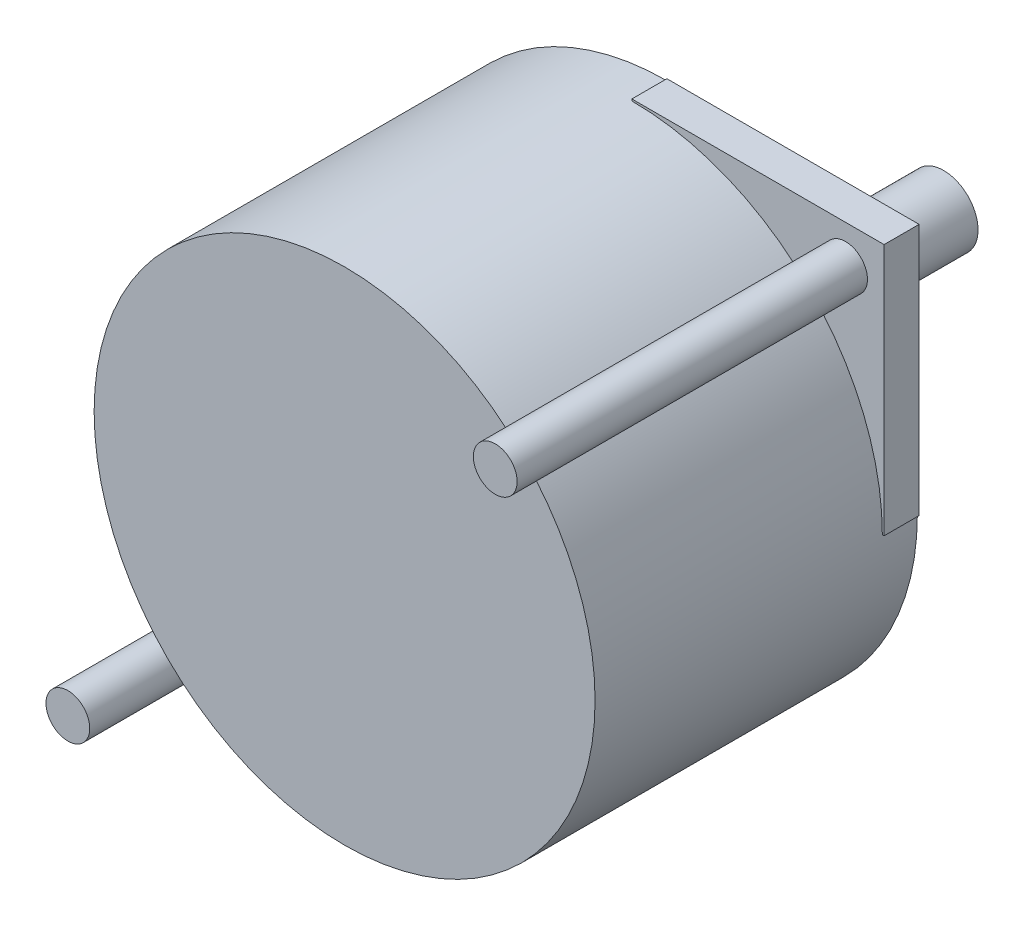
ISO-10303-21;
HEADER;
FILE_DESCRIPTION(('STEP AP214'),'2;1');
FILE_NAME('part.step','',(''),(''),'','','');
FILE_SCHEMA(('AUTOMOTIVE_DESIGN { 1 0 10303 214 1 1 1 1 }'));
ENDSEC;
DATA;
#1=APPLICATION_CONTEXT('core data for automotive mechanical design processes');
#2=APPLICATION_PROTOCOL_DEFINITION('international standard','automotive_design',2000,#1);
#3=PRODUCT_CONTEXT('',#1,'mechanical');
#4=PRODUCT('Part','Part','',(#3));
#5=PRODUCT_RELATED_PRODUCT_CATEGORY('part','',(#4));
#6=PRODUCT_DEFINITION_FORMATION('','',#4);
#7=PRODUCT_DEFINITION_CONTEXT('part definition',#1,'design');
#8=PRODUCT_DEFINITION('design','',#6,#7);
#9=PRODUCT_DEFINITION_SHAPE('','',#8);
#10=(LENGTH_UNIT() NAMED_UNIT(*) SI_UNIT(.MILLI.,.METRE.));
#11=(NAMED_UNIT(*) PLANE_ANGLE_UNIT() SI_UNIT($,.RADIAN.));
#12=(NAMED_UNIT(*) SI_UNIT($,.STERADIAN.) SOLID_ANGLE_UNIT());
#13=UNCERTAINTY_MEASURE_WITH_UNIT(LENGTH_MEASURE(1.E-05),#10,'distance_accuracy_value','');
#14=(GEOMETRIC_REPRESENTATION_CONTEXT(3) GLOBAL_UNCERTAINTY_ASSIGNED_CONTEXT((#13)) GLOBAL_UNIT_ASSIGNED_CONTEXT((#10,
#11,#12)) REPRESENTATION_CONTEXT('',''));
#15=CARTESIAN_POINT('',(0.,0.,0.));
#16=DIRECTION('',(0.,0.,1.));
#17=DIRECTION('',(1.,0.,0.));
#18=AXIS2_PLACEMENT_3D('',#15,#16,#17);
#19=CARTESIAN_POINT('',(0.,0.,2.54));
#20=DIRECTION('',(0.,0.,1.));
#21=DIRECTION('',(1.,0.,0.));
#22=AXIS2_PLACEMENT_3D('',#19,#20,#21);
#23=PLANE('',#22);
#24=CARTESIAN_POINT('',(2.15591616766473,-32.8378083832335,2.54));
#25=DIRECTION('',(0.,0.,1.));
#26=DIRECTION('',(1.,0.,0.));
#27=AXIS2_PLACEMENT_3D('',#24,#25,#26);
#28=CIRCLE('',#27,1.5875);
#29=CARTESIAN_POINT('',(3.74341616766473,-32.8378083832335,2.54));
#30=VERTEX_POINT('',#29);
#31=EDGE_CURVE('E166',#30,#30,#28,.T.);
#32=ORIENTED_EDGE('',*,*,#31,.F.);
#33=EDGE_LOOP('',(#32));
#34=FACE_BOUND('',#33,.T.);
#35=DIRECTION('',(0.,-1.,0.));
#36=VECTOR('',#35,1.);
#37=CARTESIAN_POINT('',(17.6499161676647,-35.6318083832335,2.54));
#38=LINE('',#37,#36);
#39=CARTESIAN_POINT('',(17.6499161676647,-35.5048083832335,2.54));
#40=VERTEX_POINT('',#39);
#41=CARTESIAN_POINT('',(17.6499161676647,-35.6318083832335,2.54));
#42=VERTEX_POINT('',#41);
#43=EDGE_CURVE('E133',#40,#42,#38,.T.);
#44=ORIENTED_EDGE('',*,*,#43,.F.);
#45=CARTESIAN_POINT('',(17.6499161676647,-17.3438083832335,2.54));
#46=DIRECTION('',(0.,0.,1.));
#47=DIRECTION('',(1.,0.,0.));
#48=AXIS2_PLACEMENT_3D('',#45,#46,#47);
#49=CIRCLE('',#48,18.161);
#50=CARTESIAN_POINT('',(-0.511083832335335,-17.3438083832335,2.54));
#51=VERTEX_POINT('',#50);
#52=EDGE_CURVE('E121',#51,#40,#49,.T.);
#53=ORIENTED_EDGE('',*,*,#52,.F.);
#54=DIRECTION('',(1.,0.,0.));
#55=VECTOR('',#54,1.);
#56=CARTESIAN_POINT('',(-0.638083832335327,-17.3438083832335,2.54));
#57=LINE('',#56,#55);
#58=CARTESIAN_POINT('',(-0.638083832335327,-17.3438083832335,2.54));
#59=VERTEX_POINT('',#58);
#60=EDGE_CURVE('E148',#59,#51,#57,.T.);
#61=ORIENTED_EDGE('',*,*,#60,.F.);
#62=DIRECTION('',(0.,-1.,0.));
#63=VECTOR('',#62,1.);
#64=CARTESIAN_POINT('',(-0.638083832335329,0.944191616766467,2.54));
#65=LINE('',#64,#63);
#66=CARTESIAN_POINT('',(-0.638083832335325,-35.6318083832335,2.54));
#67=VERTEX_POINT('',#66);
#68=EDGE_CURVE('E184',#59,#67,#65,.T.);
#69=ORIENTED_EDGE('',*,*,#68,.T.);
#70=DIRECTION('',(1.,0.,0.));
#71=VECTOR('',#70,1.);
#72=CARTESIAN_POINT('',(-0.638083832335325,-35.6318083832335,2.54));
#73=LINE('',#72,#71);
#74=EDGE_CURVE('E186',#67,#42,#73,.T.);
#75=ORIENTED_EDGE('',*,*,#74,.T.);
#76=EDGE_LOOP('',(#44,#53,#61,#69,#75));
#77=FACE_BOUND('',#76,.T.);
#78=ADVANCED_FACE('F34',(#34,#77),#23,.T.);
#79=CARTESIAN_POINT('',(33.1439161676646,-1.84980838323354,2.54));
#80=DIRECTION('',(0.,0.,1.));
#81=DIRECTION('',(1.,0.,0.));
#82=AXIS2_PLACEMENT_3D('',#79,#80,#81);
#83=CIRCLE('',#82,1.5875);
#84=CARTESIAN_POINT('',(34.7314161676646,-1.84980838323354,2.54));
#85=VERTEX_POINT('',#84);
#86=EDGE_CURVE('E175',#85,#85,#83,.T.);
#87=ORIENTED_EDGE('',*,*,#86,.F.);
#88=EDGE_LOOP('',(#87));
#89=FACE_BOUND('',#88,.T.);
#90=DIRECTION('',(0.,1.,0.));
#91=VECTOR('',#90,1.);
#92=CARTESIAN_POINT('',(17.6499161676647,0.944191616766467,2.54));
#93=LINE('',#92,#91);
#94=CARTESIAN_POINT('',(17.6499161676647,0.817191616766473,2.54));
#95=VERTEX_POINT('',#94);
#96=CARTESIAN_POINT('',(17.6499161676647,0.944191616766467,2.54));
#97=VERTEX_POINT('',#96);
#98=EDGE_CURVE('E118',#95,#97,#93,.T.);
#99=ORIENTED_EDGE('',*,*,#98,.F.);
#100=CARTESIAN_POINT('',(35.8109161676647,-17.3438083832335,2.54));
#101=VERTEX_POINT('',#100);
#102=EDGE_CURVE('E112',#101,#95,#49,.T.);
#103=ORIENTED_EDGE('',*,*,#102,.F.);
#104=DIRECTION('',(-1.,0.,0.));
#105=VECTOR('',#104,1.);
#106=CARTESIAN_POINT('',(35.9379161676647,-17.3438083832335,2.54));
#107=LINE('',#106,#105);
#108=CARTESIAN_POINT('',(35.9379161676647,-17.3438083832335,2.54));
#109=VERTEX_POINT('',#108);
#110=EDGE_CURVE('E115',#109,#101,#107,.T.);
#111=ORIENTED_EDGE('',*,*,#110,.F.);
#112=DIRECTION('',(0.,1.,0.));
#113=VECTOR('',#112,1.);
#114=CARTESIAN_POINT('',(35.9379161676647,0.944191616766467,2.54));
#115=LINE('',#114,#113);
#116=CARTESIAN_POINT('',(35.9379161676647,0.944191616766467,2.54));
#117=VERTEX_POINT('',#116);
#118=EDGE_CURVE('E190',#109,#117,#115,.T.);
#119=ORIENTED_EDGE('',*,*,#118,.T.);
#120=DIRECTION('',(-1.,0.,0.));
#121=VECTOR('',#120,1.);
#122=CARTESIAN_POINT('',(-0.638083832335329,0.944191616766467,2.54));
#123=LINE('',#122,#121);
#124=EDGE_CURVE('E192',#117,#97,#123,.T.);
#125=ORIENTED_EDGE('',*,*,#124,.T.);
#126=EDGE_LOOP('',(#99,#103,#111,#119,#125));
#127=FACE_BOUND('',#126,.T.);
#128=ADVANCED_FACE('F113',(#89,#127),#23,.T.);
#129=CARTESIAN_POINT('',(17.6499161676647,-17.3438083832335,-1.016));
#130=DIRECTION('',(0.,0.,-1.));
#131=DIRECTION('',(-1.,0.,0.));
#132=AXIS2_PLACEMENT_3D('',#129,#130,#131);
#133=PLANE('',#132);
#134=CARTESIAN_POINT('',(17.6499161676647,-17.3438083832335,-1.016));
#135=DIRECTION('',(0.,0.,-1.));
#136=DIRECTION('',(-1.,0.,0.));
#137=AXIS2_PLACEMENT_3D('',#134,#135,#136);
#138=CIRCLE('',#137,8.001);
#139=CARTESIAN_POINT('',(9.64891616766467,-17.3438083832335,-1.016));
#140=VERTEX_POINT('',#139);
#141=EDGE_CURVE('E134',#140,#140,#138,.T.);
#142=ORIENTED_EDGE('',*,*,#141,.T.);
#143=EDGE_LOOP('',(#142));
#144=FACE_BOUND('',#143,.T.);
#145=CARTESIAN_POINT('',(17.6499161676647,-17.3438083832335,-1.016));
#146=DIRECTION('',(0.,0.,-1.));
#147=DIRECTION('',(-1.,0.,0.));
#148=AXIS2_PLACEMENT_3D('',#145,#146,#147);
#149=CIRCLE('',#148,2.49555);
#150=CARTESIAN_POINT('',(15.1543661676647,-17.3438083832335,-1.016));
#151=VERTEX_POINT('',#150);
#152=EDGE_CURVE('E222',#151,#151,#149,.T.);
#153=ORIENTED_EDGE('',*,*,#152,.F.);
#154=EDGE_LOOP('',(#153));
#155=FACE_BOUND('',#154,.T.);
#156=ADVANCED_FACE('F251',(#144,#155),#133,.T.);
#157=CARTESIAN_POINT('',(0.,0.,0.));
#158=DIRECTION('',(0.,0.,1.));
#159=DIRECTION('',(1.,0.,0.));
#160=AXIS2_PLACEMENT_3D('',#157,#158,#159);
#161=PLANE('',#160);
#162=CARTESIAN_POINT('',(17.6499161676647,-17.3438083832335,0.));
#163=DIRECTION('',(0.,0.,-1.));
#164=DIRECTION('',(1.,0.,0.));
#165=AXIS2_PLACEMENT_3D('',#162,#163,#164);
#166=CIRCLE('',#165,18.161);
#167=CARTESIAN_POINT('',(35.8109161676647,-17.3438083832335,0.));
#168=VERTEX_POINT('',#167);
#169=CARTESIAN_POINT('',(17.6499161676647,-35.5048083832335,0.));
#170=VERTEX_POINT('',#169);
#171=EDGE_CURVE('E49',#168,#170,#166,.T.);
#172=ORIENTED_EDGE('',*,*,#171,.T.);
#173=DIRECTION('',(0.,-1.,0.));
#174=VECTOR('',#173,1.);
#175=CARTESIAN_POINT('',(17.6499161676647,-35.6318083832335,0.));
#176=LINE('',#175,#174);
#177=CARTESIAN_POINT('',(17.6499161676647,-35.6318083832335,0.));
#178=VERTEX_POINT('',#177);
#179=EDGE_CURVE('E142',#170,#178,#176,.T.);
#180=ORIENTED_EDGE('',*,*,#179,.T.);
#181=DIRECTION('',(1.,0.,0.));
#182=VECTOR('',#181,1.);
#183=CARTESIAN_POINT('',(-0.638083832335325,-35.6318083832335,0.));
#184=LINE('',#183,#182);
#185=CARTESIAN_POINT('',(-0.638083832335325,-35.6318083832335,0.));
#186=VERTEX_POINT('',#185);
#187=EDGE_CURVE('E196',#186,#178,#184,.T.);
#188=ORIENTED_EDGE('',*,*,#187,.F.);
#189=DIRECTION('',(0.,-1.,0.));
#190=VECTOR('',#189,1.);
#191=CARTESIAN_POINT('',(-0.638083832335329,0.944191616766467,0.));
#192=LINE('',#191,#190);
#193=CARTESIAN_POINT('',(-0.638083832335327,-17.3438083832335,0.));
#194=VERTEX_POINT('',#193);
#195=EDGE_CURVE('E181',#194,#186,#192,.T.);
#196=ORIENTED_EDGE('',*,*,#195,.F.);
#197=DIRECTION('',(1.,0.,0.));
#198=VECTOR('',#197,1.);
#199=CARTESIAN_POINT('',(-0.638083832335327,-17.3438083832335,0.));
#200=LINE('',#199,#198);
#201=CARTESIAN_POINT('',(-0.511083832335335,-17.3438083832335,0.));
#202=VERTEX_POINT('',#201);
#203=EDGE_CURVE('E152',#194,#202,#200,.T.);
#204=ORIENTED_EDGE('',*,*,#203,.T.);
#205=CARTESIAN_POINT('',(17.6499161676647,-17.3438083832335,0.));
#206=DIRECTION('',(0.,0.,-1.));
#207=DIRECTION('',(1.,0.,0.));
#208=AXIS2_PLACEMENT_3D('',#205,#206,#207);
#209=CIRCLE('',#208,18.161);
#210=CARTESIAN_POINT('',(17.6499161676647,0.817191616766473,0.));
#211=VERTEX_POINT('',#210);
#212=EDGE_CURVE('E56',#202,#211,#209,.T.);
#213=ORIENTED_EDGE('',*,*,#212,.T.);
#214=DIRECTION('',(0.,1.,0.));
#215=VECTOR('',#214,1.);
#216=CARTESIAN_POINT('',(17.6499161676647,0.944191616766467,0.));
#217=LINE('',#216,#215);
#218=CARTESIAN_POINT('',(17.6499161676647,0.944191616766467,0.));
#219=VERTEX_POINT('',#218);
#220=EDGE_CURVE('E156',#211,#219,#217,.T.);
#221=ORIENTED_EDGE('',*,*,#220,.T.);
#222=DIRECTION('',(-1.,0.,0.));
#223=VECTOR('',#222,1.);
#224=CARTESIAN_POINT('',(-0.638083832335329,0.944191616766467,0.));
#225=LINE('',#224,#223);
#226=CARTESIAN_POINT('',(35.9379161676647,0.944191616766467,0.));
#227=VERTEX_POINT('',#226);
#228=EDGE_CURVE('E187',#227,#219,#225,.T.);
#229=ORIENTED_EDGE('',*,*,#228,.F.);
#230=DIRECTION('',(0.,1.,0.));
#231=VECTOR('',#230,1.);
#232=CARTESIAN_POINT('',(35.9379161676647,0.944191616766467,0.));
#233=LINE('',#232,#231);
#234=CARTESIAN_POINT('',(35.9379161676647,-17.3438083832335,0.));
#235=VERTEX_POINT('',#234);
#236=EDGE_CURVE('E199',#235,#227,#233,.T.);
#237=ORIENTED_EDGE('',*,*,#236,.F.);
#238=DIRECTION('',(-1.,0.,0.));
#239=VECTOR('',#238,1.);
#240=CARTESIAN_POINT('',(35.9379161676647,-17.3438083832335,0.));
#241=LINE('',#240,#239);
#242=EDGE_CURVE('E136',#235,#168,#241,.T.);
#243=ORIENTED_EDGE('',*,*,#242,.T.);
#244=EDGE_LOOP('',(#172,#180,#188,#196,#204,#213,#221,#229,#237,#243));
#245=FACE_BOUND('',#244,.T.);
#246=CARTESIAN_POINT('',(17.6499161676647,-17.3438083832335,0.));
#247=DIRECTION('',(0.,0.,1.));
#248=DIRECTION('',(1.,0.,0.));
#249=AXIS2_PLACEMENT_3D('',#246,#247,#248);
#250=CIRCLE('',#249,8.001);
#251=CARTESIAN_POINT('',(25.6509161676647,-17.3438083832335,0.));
#252=VERTEX_POINT('',#251);
#253=EDGE_CURVE('E11',#252,#252,#250,.F.);
#254=ORIENTED_EDGE('',*,*,#253,.F.);
#255=EDGE_LOOP('',(#254));
#256=FACE_BOUND('',#255,.T.);
#257=ADVANCED_FACE('F216',(#245,#256),#161,.F.);
#258=CARTESIAN_POINT('',(-0.638083832335329,0.944191616766467,2.54));
#259=DIRECTION('',(1.,0.,0.));
#260=DIRECTION('',(0.,1.,0.));
#261=AXIS2_PLACEMENT_3D('',#258,#259,#260);
#262=PLANE('',#261);
#263=ORIENTED_EDGE('',*,*,#68,.F.);
#264=DIRECTION('',(0.,0.,1.));
#265=VECTOR('',#264,1.);
#266=CARTESIAN_POINT('',(-0.638083832335327,-17.3438083832335,0.));
#267=LINE('',#266,#265);
#268=EDGE_CURVE('E159',#194,#59,#267,.T.);
#269=ORIENTED_EDGE('',*,*,#268,.F.);
#270=ORIENTED_EDGE('',*,*,#195,.T.);
#271=DIRECTION('',(0.,0.,-1.));
#272=VECTOR('',#271,1.);
#273=CARTESIAN_POINT('',(-0.638083832335325,-35.6318083832335,2.54));
#274=LINE('',#273,#272);
#275=EDGE_CURVE('E42',#67,#186,#274,.T.);
#276=ORIENTED_EDGE('',*,*,#275,.F.);
#277=EDGE_LOOP('',(#263,#269,#270,#276));
#278=FACE_BOUND('',#277,.T.);
#279=ADVANCED_FACE('F36',(#278),#262,.F.);
#280=CARTESIAN_POINT('',(-0.638083832335325,-35.6318083832335,2.54));
#281=DIRECTION('',(0.,1.,0.));
#282=DIRECTION('',(0.,0.,1.));
#283=AXIS2_PLACEMENT_3D('',#280,#281,#282);
#284=PLANE('',#283);
#285=ORIENTED_EDGE('',*,*,#187,.T.);
#286=DIRECTION('',(0.,0.,1.));
#287=VECTOR('',#286,1.);
#288=CARTESIAN_POINT('',(17.6499161676647,-35.6318083832335,0.));
#289=LINE('',#288,#287);
#290=EDGE_CURVE('E145',#178,#42,#289,.T.);
#291=ORIENTED_EDGE('',*,*,#290,.T.);
#292=ORIENTED_EDGE('',*,*,#74,.F.);
#293=ORIENTED_EDGE('',*,*,#275,.T.);
#294=EDGE_LOOP('',(#285,#291,#292,#293));
#295=FACE_BOUND('',#294,.T.);
#296=ADVANCED_FACE('F208',(#295),#284,.F.);
#297=CARTESIAN_POINT('',(35.9379161676647,0.944191616766467,2.54));
#298=DIRECTION('',(-1.,0.,0.));
#299=DIRECTION('',(0.,-1.,0.));
#300=AXIS2_PLACEMENT_3D('',#297,#298,#299);
#301=PLANE('',#300);
#302=ORIENTED_EDGE('',*,*,#118,.F.);
#303=DIRECTION('',(0.,0.,1.));
#304=VECTOR('',#303,1.);
#305=CARTESIAN_POINT('',(35.9379161676647,-17.3438083832335,0.));
#306=LINE('',#305,#304);
#307=EDGE_CURVE('E129',#235,#109,#306,.T.);
#308=ORIENTED_EDGE('',*,*,#307,.F.);
#309=ORIENTED_EDGE('',*,*,#236,.T.);
#310=DIRECTION('',(0.,0.,-1.));
#311=VECTOR('',#310,1.);
#312=CARTESIAN_POINT('',(35.9379161676647,0.944191616766467,2.54));
#313=LINE('',#312,#311);
#314=EDGE_CURVE('E194',#117,#227,#313,.T.);
#315=ORIENTED_EDGE('',*,*,#314,.F.);
#316=EDGE_LOOP('',(#302,#308,#309,#315));
#317=FACE_BOUND('',#316,.T.);
#318=ADVANCED_FACE('F264',(#317),#301,.F.);
#319=CARTESIAN_POINT('',(-0.638083832335329,0.944191616766467,2.54));
#320=DIRECTION('',(0.,-1.,0.));
#321=DIRECTION('',(0.,0.,-1.));
#322=AXIS2_PLACEMENT_3D('',#319,#320,#321);
#323=PLANE('',#322);
#324=ORIENTED_EDGE('',*,*,#228,.T.);
#325=DIRECTION('',(0.,0.,1.));
#326=VECTOR('',#325,1.);
#327=CARTESIAN_POINT('',(17.6499161676647,0.944191616766467,0.));
#328=LINE('',#327,#326);
#329=EDGE_CURVE('E163',#219,#97,#328,.T.);
#330=ORIENTED_EDGE('',*,*,#329,.T.);
#331=ORIENTED_EDGE('',*,*,#124,.F.);
#332=ORIENTED_EDGE('',*,*,#314,.T.);
#333=EDGE_LOOP('',(#324,#330,#331,#332));
#334=FACE_BOUND('',#333,.T.);
#335=ADVANCED_FACE('F261',(#334),#323,.F.);
#336=CARTESIAN_POINT('',(33.1439161676646,-1.84980838323354,27.94));
#337=DIRECTION('',(0.,0.,-1.));
#338=DIRECTION('',(-1.,0.,0.));
#339=AXIS2_PLACEMENT_3D('',#336,#337,#338);
#340=CYLINDRICAL_SURFACE('',#339,1.5875);
#341=CARTESIAN_POINT('',(33.1439161676646,-1.84980838323354,27.94));
#342=DIRECTION('',(0.,0.,1.));
#343=DIRECTION('',(1.,0.,0.));
#344=AXIS2_PLACEMENT_3D('',#341,#342,#343);
#345=CIRCLE('',#344,1.5875);
#346=CARTESIAN_POINT('',(34.7314161676646,-1.84980838323354,27.94));
#347=VERTEX_POINT('',#346);
#348=EDGE_CURVE('E178',#347,#347,#345,.T.);
#349=ORIENTED_EDGE('',*,*,#348,.F.);
#350=EDGE_LOOP('',(#349));
#351=FACE_BOUND('',#350,.T.);
#352=ORIENTED_EDGE('',*,*,#86,.T.);
#353=EDGE_LOOP('',(#352));
#354=FACE_BOUND('',#353,.T.);
#355=ADVANCED_FACE('F257',(#351,#354),#340,.T.);
#356=CARTESIAN_POINT('',(33.1439161676646,-1.84980838323354,27.94));
#357=DIRECTION('',(0.,0.,1.));
#358=DIRECTION('',(1.,0.,0.));
#359=AXIS2_PLACEMENT_3D('',#356,#357,#358);
#360=PLANE('',#359);
#361=ORIENTED_EDGE('',*,*,#348,.T.);
#362=EDGE_LOOP('',(#361));
#363=FACE_BOUND('',#362,.T.);
#364=ADVANCED_FACE('F404',(#363),#360,.T.);
#365=CARTESIAN_POINT('',(2.15591616766473,-32.8378083832335,27.94));
#366=DIRECTION('',(0.,0.,-1.));
#367=DIRECTION('',(-1.,0.,0.));
#368=AXIS2_PLACEMENT_3D('',#365,#366,#367);
#369=CYLINDRICAL_SURFACE('',#368,1.5875);
#370=CARTESIAN_POINT('',(2.15591616766473,-32.8378083832335,27.94));
#371=DIRECTION('',(0.,0.,1.));
#372=DIRECTION('',(1.,0.,0.));
#373=AXIS2_PLACEMENT_3D('',#370,#371,#372);
#374=CIRCLE('',#373,1.5875);
#375=CARTESIAN_POINT('',(3.74341616766473,-32.8378083832335,27.94));
#376=VERTEX_POINT('',#375);
#377=EDGE_CURVE('E172',#376,#376,#374,.T.);
#378=ORIENTED_EDGE('',*,*,#377,.F.);
#379=EDGE_LOOP('',(#378));
#380=FACE_BOUND('',#379,.T.);
#381=ORIENTED_EDGE('',*,*,#31,.T.);
#382=EDGE_LOOP('',(#381));
#383=FACE_BOUND('',#382,.T.);
#384=ADVANCED_FACE('F397',(#380,#383),#369,.T.);
#385=CARTESIAN_POINT('',(2.15591616766473,-32.8378083832335,27.94));
#386=DIRECTION('',(0.,0.,1.));
#387=DIRECTION('',(1.,0.,0.));
#388=AXIS2_PLACEMENT_3D('',#385,#386,#387);
#389=PLANE('',#388);
#390=ORIENTED_EDGE('',*,*,#377,.T.);
#391=EDGE_LOOP('',(#390));
#392=FACE_BOUND('',#391,.T.);
#393=ADVANCED_FACE('F242',(#392),#389,.T.);
#394=CARTESIAN_POINT('',(17.6499161676647,0.944191616766467,0.));
#395=DIRECTION('',(1.,0.,0.));
#396=DIRECTION('',(0.,0.,-1.));
#397=AXIS2_PLACEMENT_3D('',#394,#395,#396);
#398=PLANE('',#397);
#399=ORIENTED_EDGE('',*,*,#98,.T.);
#400=ORIENTED_EDGE('',*,*,#329,.F.);
#401=ORIENTED_EDGE('',*,*,#220,.F.);
#402=DIRECTION('',(0.,0.,1.));
#403=VECTOR('',#402,1.);
#404=CARTESIAN_POINT('',(17.6499161676647,0.817191616766473,0.));
#405=LINE('',#404,#403);
#406=EDGE_CURVE('E167',#211,#95,#405,.T.);
#407=ORIENTED_EDGE('',*,*,#406,.T.);
#408=EDGE_LOOP('',(#399,#400,#401,#407));
#409=FACE_BOUND('',#408,.T.);
#410=ADVANCED_FACE('F233',(#409),#398,.F.);
#411=CARTESIAN_POINT('',(17.6499161676647,-17.3438083832335,0.));
#412=DIRECTION('',(0.,0.,1.));
#413=DIRECTION('',(1.,0.,0.));
#414=AXIS2_PLACEMENT_3D('',#411,#412,#413);
#415=CYLINDRICAL_SURFACE('',#414,18.161);
#416=DIRECTION('',(0.,0.,1.));
#417=VECTOR('',#416,1.);
#418=CARTESIAN_POINT('',(-0.511083832335335,-17.3438083832335,0.));
#419=LINE('',#418,#417);
#420=EDGE_CURVE('E169',#202,#51,#419,.T.);
#421=ORIENTED_EDGE('',*,*,#420,.T.);
#422=ORIENTED_EDGE('',*,*,#52,.T.);
#423=DIRECTION('',(0.,0.,1.));
#424=VECTOR('',#423,1.);
#425=CARTESIAN_POINT('',(17.6499161676647,-35.5048083832335,0.));
#426=LINE('',#425,#424);
#427=EDGE_CURVE('E128',#170,#40,#426,.T.);
#428=ORIENTED_EDGE('',*,*,#427,.F.);
#429=ORIENTED_EDGE('',*,*,#171,.F.);
#430=DIRECTION('',(0.,0.,1.));
#431=VECTOR('',#430,1.);
#432=CARTESIAN_POINT('',(35.8109161676647,-17.3438083832335,0.));
#433=LINE('',#432,#431);
#434=EDGE_CURVE('E123',#168,#101,#433,.T.);
#435=ORIENTED_EDGE('',*,*,#434,.T.);
#436=ORIENTED_EDGE('',*,*,#102,.T.);
#437=ORIENTED_EDGE('',*,*,#406,.F.);
#438=ORIENTED_EDGE('',*,*,#212,.F.);
#439=EDGE_LOOP('',(#421,#422,#428,#429,#435,#436,#437,#438));
#440=FACE_BOUND('',#439,.T.);
#441=CARTESIAN_POINT('',(17.6499161676647,-17.3438083832335,23.368));
#442=DIRECTION('',(0.,0.,1.));
#443=DIRECTION('',(1.,0.,0.));
#444=AXIS2_PLACEMENT_3D('',#441,#442,#443);
#445=CIRCLE('',#444,18.161);
#446=CARTESIAN_POINT('',(35.8109161676647,-17.3438083832335,23.368));
#447=VERTEX_POINT('',#446);
#448=EDGE_CURVE('E120',#447,#447,#445,.T.);
#449=ORIENTED_EDGE('',*,*,#448,.F.);
#450=EDGE_LOOP('',(#449));
#451=FACE_BOUND('',#450,.T.);
#452=ADVANCED_FACE('F124',(#440,#451),#415,.T.);
#453=CARTESIAN_POINT('',(-0.638083832335327,-17.3438083832335,0.));
#454=DIRECTION('',(0.,-1.,0.));
#455=DIRECTION('',(0.,0.,-1.));
#456=AXIS2_PLACEMENT_3D('',#453,#454,#455);
#457=PLANE('',#456);
#458=ORIENTED_EDGE('',*,*,#60,.T.);
#459=ORIENTED_EDGE('',*,*,#420,.F.);
#460=ORIENTED_EDGE('',*,*,#203,.F.);
#461=ORIENTED_EDGE('',*,*,#268,.T.);
#462=EDGE_LOOP('',(#458,#459,#460,#461));
#463=FACE_BOUND('',#462,.T.);
#464=ADVANCED_FACE('F232',(#463),#457,.F.);
#465=CARTESIAN_POINT('',(17.6499161676647,-35.6318083832335,0.));
#466=DIRECTION('',(-1.,0.,0.));
#467=DIRECTION('',(0.,-1.,0.));
#468=AXIS2_PLACEMENT_3D('',#465,#466,#467);
#469=PLANE('',#468);
#470=ORIENTED_EDGE('',*,*,#43,.T.);
#471=ORIENTED_EDGE('',*,*,#290,.F.);
#472=ORIENTED_EDGE('',*,*,#179,.F.);
#473=ORIENTED_EDGE('',*,*,#427,.T.);
#474=EDGE_LOOP('',(#470,#471,#472,#473));
#475=FACE_BOUND('',#474,.T.);
#476=ADVANCED_FACE('F239',(#475),#469,.F.);
#477=CARTESIAN_POINT('',(35.9379161676647,-17.3438083832335,0.));
#478=DIRECTION('',(0.,1.,0.));
#479=DIRECTION('',(0.,0.,1.));
#480=AXIS2_PLACEMENT_3D('',#477,#478,#479);
#481=PLANE('',#480);
#482=ORIENTED_EDGE('',*,*,#110,.T.);
#483=ORIENTED_EDGE('',*,*,#434,.F.);
#484=ORIENTED_EDGE('',*,*,#242,.F.);
#485=ORIENTED_EDGE('',*,*,#307,.T.);
#486=EDGE_LOOP('',(#482,#483,#484,#485));
#487=FACE_BOUND('',#486,.T.);
#488=ADVANCED_FACE('F131',(#487),#481,.F.);
#489=CARTESIAN_POINT('',(17.6499161676647,-17.3438083832335,-1.016));
#490=DIRECTION('',(0.,0.,1.));
#491=DIRECTION('',(1.,0.,0.));
#492=AXIS2_PLACEMENT_3D('',#489,#490,#491);
#493=CYLINDRICAL_SURFACE('',#492,8.001);
#494=ORIENTED_EDGE('',*,*,#141,.F.);
#495=EDGE_LOOP('',(#494));
#496=FACE_BOUND('',#495,.T.);
#497=ORIENTED_EDGE('',*,*,#253,.T.);
#498=EDGE_LOOP('',(#497));
#499=FACE_BOUND('',#498,.T.);
#500=ADVANCED_FACE('F335',(#496,#499),#493,.T.);
#501=CARTESIAN_POINT('',(17.6499161676647,-17.3438083832335,-20.066));
#502=DIRECTION('',(0.,0.,1.));
#503=DIRECTION('',(1.,0.,0.));
#504=AXIS2_PLACEMENT_3D('',#501,#502,#503);
#505=CYLINDRICAL_SURFACE('',#504,2.49555);
#506=CARTESIAN_POINT('',(17.6499161676647,-17.3438083832335,-20.066));
#507=DIRECTION('',(0.,0.,-1.));
#508=DIRECTION('',(-1.,0.,0.));
#509=AXIS2_PLACEMENT_3D('',#506,#507,#508);
#510=CIRCLE('',#509,2.49555);
#511=CARTESIAN_POINT('',(15.1543661676647,-17.3438083832335,-20.066));
#512=VERTEX_POINT('',#511);
#513=EDGE_CURVE('E139',#512,#512,#510,.T.);
#514=ORIENTED_EDGE('',*,*,#513,.F.);
#515=EDGE_LOOP('',(#514));
#516=FACE_BOUND('',#515,.T.);
#517=ORIENTED_EDGE('',*,*,#152,.T.);
#518=EDGE_LOOP('',(#517));
#519=FACE_BOUND('',#518,.T.);
#520=ADVANCED_FACE('F351',(#516,#519),#505,.T.);
#521=CARTESIAN_POINT('',(17.6499161676647,-17.3438083832335,-20.066));
#522=DIRECTION('',(0.,0.,-1.));
#523=DIRECTION('',(-1.,0.,0.));
#524=AXIS2_PLACEMENT_3D('',#521,#522,#523);
#525=PLANE('',#524);
#526=ORIENTED_EDGE('',*,*,#513,.T.);
#527=EDGE_LOOP('',(#526));
#528=FACE_BOUND('',#527,.T.);
#529=ADVANCED_FACE('F343',(#528),#525,.T.);
#530=CARTESIAN_POINT('',(17.6499161676647,-17.3438083832335,23.368));
#531=DIRECTION('',(0.,0.,1.));
#532=DIRECTION('',(1.,0.,0.));
#533=AXIS2_PLACEMENT_3D('',#530,#531,#532);
#534=PLANE('',#533);
#535=ORIENTED_EDGE('',*,*,#448,.T.);
#536=EDGE_LOOP('',(#535));
#537=FACE_BOUND('',#536,.T.);
#538=ADVANCED_FACE('F230',(#537),#534,.T.);
#539=CLOSED_SHELL('',(#78,#128,#156,#257,#279,#296,#318,#335,#355,#364,#384,#393,#410,#452,#464,
#476,#488,#500,#520,#529,#538));
#540=MANIFOLD_SOLID_BREP('B2',#539);
#541=ADVANCED_BREP_SHAPE_REPRESENTATION('',(#18,#540),#14);
#542=SHAPE_DEFINITION_REPRESENTATION(#9,#541);
ENDSEC;
END-ISO-10303-21;
